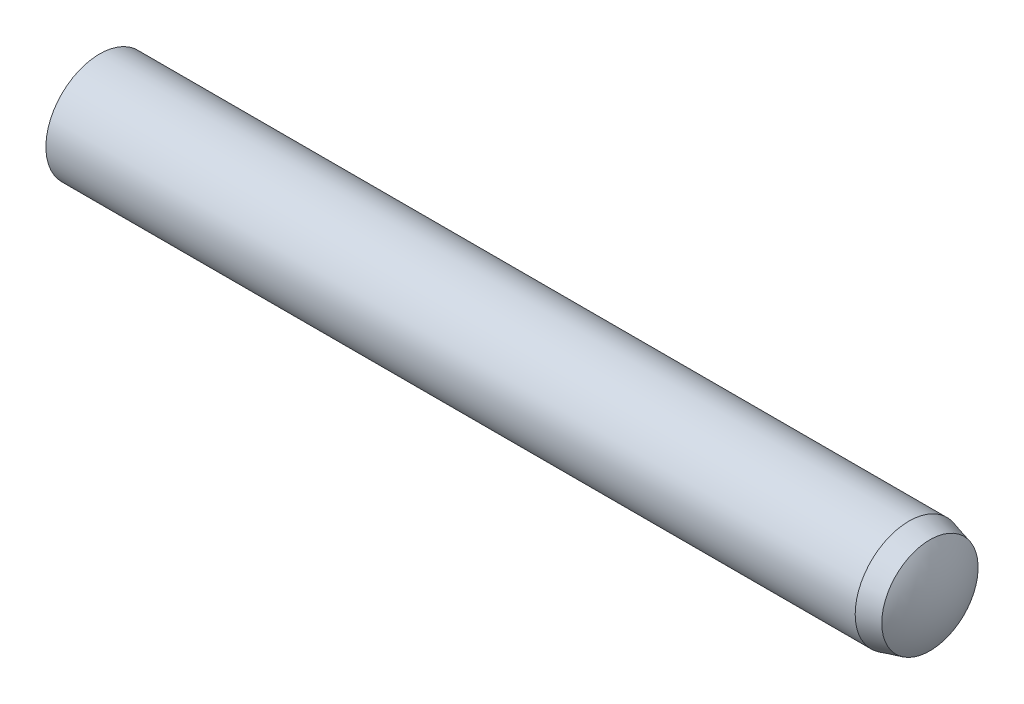
ISO-10303-21;
HEADER;
FILE_DESCRIPTION(('STEP AP214'),'2;1');
FILE_NAME('part.step','',(''),(''),'','','');
FILE_SCHEMA(('AUTOMOTIVE_DESIGN { 1 0 10303 214 1 1 1 1 }'));
ENDSEC;
DATA;
#1=APPLICATION_CONTEXT('core data for automotive mechanical design processes');
#2=APPLICATION_PROTOCOL_DEFINITION('international standard','automotive_design',2000,#1);
#3=PRODUCT_CONTEXT('',#1,'mechanical');
#4=PRODUCT('Part','Part','',(#3));
#5=PRODUCT_RELATED_PRODUCT_CATEGORY('part','',(#4));
#6=PRODUCT_DEFINITION_FORMATION('','',#4);
#7=PRODUCT_DEFINITION_CONTEXT('part definition',#1,'design');
#8=PRODUCT_DEFINITION('design','',#6,#7);
#9=PRODUCT_DEFINITION_SHAPE('','',#8);
#10=(LENGTH_UNIT() NAMED_UNIT(*) SI_UNIT(.MILLI.,.METRE.));
#11=(NAMED_UNIT(*) PLANE_ANGLE_UNIT() SI_UNIT($,.RADIAN.));
#12=(NAMED_UNIT(*) SI_UNIT($,.STERADIAN.) SOLID_ANGLE_UNIT());
#13=UNCERTAINTY_MEASURE_WITH_UNIT(LENGTH_MEASURE(1.E-05),#10,'distance_accuracy_value','');
#14=(GEOMETRIC_REPRESENTATION_CONTEXT(3) GLOBAL_UNCERTAINTY_ASSIGNED_CONTEXT((#13)) GLOBAL_UNIT_ASSIGNED_CONTEXT((#10,
#11,#12)) REPRESENTATION_CONTEXT('',''));
#15=CARTESIAN_POINT('',(0.,0.,0.));
#16=DIRECTION('',(0.,0.,1.));
#17=DIRECTION('',(1.,0.,0.));
#18=AXIS2_PLACEMENT_3D('',#15,#16,#17);
#19=CARTESIAN_POINT('',(7.9098078880317,0.,0.));
#20=DIRECTION('',(0.,1.,0.));
#21=DIRECTION('',(1.,0.,0.));
#22=AXIS2_PLACEMENT_3D('',#19,#20,#21);
#23=SPHERICAL_SURFACE('',#22,2.0901921119683);
#24=CARTESIAN_POINT('',(9.6749999999588,0.,0.));
#25=DIRECTION('',(-1.,0.,0.));
#26=DIRECTION('',(0.,0.,1.));
#27=AXIS2_PLACEMENT_3D('',#24,#25,#26);
#28=CIRCLE('',#27,1.11937476870594);
#29=CARTESIAN_POINT('',(9.6749999999588,0.,1.11937476870594));
#30=VERTEX_POINT('',#29);
#31=EDGE_CURVE('E18',#30,#30,#28,.T.);
#32=ORIENTED_EDGE('',*,*,#31,.F.);
#33=EDGE_LOOP('',(#32));
#34=FACE_BOUND('',#33,.T.);
#35=ADVANCED_FACE('F14',(#34),#23,.T.);
#36=CARTESIAN_POINT('',(9.18750000005275,0.,0.));
#37=DIRECTION('',(-1.,0.,0.));
#38=DIRECTION('',(0.,0.,1.));
#39=AXIS2_PLACEMENT_3D('',#36,#37,#38);
#40=CONICAL_SURFACE('',#39,1.24999999999886,0.261799387814319);
#41=CARTESIAN_POINT('',(9.1875,0.,0.));
#42=DIRECTION('',(1.,0.,0.));
#43=DIRECTION('',(0.,0.,-1.));
#44=AXIS2_PLACEMENT_3D('',#41,#42,#43);
#45=CIRCLE('',#44,1.25);
#46=CARTESIAN_POINT('',(9.1875,0.,-1.25));
#47=VERTEX_POINT('',#46);
#48=EDGE_CURVE('E10',#47,#47,#45,.F.);
#49=ORIENTED_EDGE('',*,*,#48,.F.);
#50=EDGE_LOOP('',(#49));
#51=FACE_BOUND('',#50,.T.);
#52=ORIENTED_EDGE('',*,*,#31,.T.);
#53=EDGE_LOOP('',(#52));
#54=FACE_BOUND('',#53,.T.);
#55=ADVANCED_FACE('F35',(#51,#54),#40,.T.);
#56=CARTESIAN_POINT('',(-7.72916666666667,0.,0.));
#57=DIRECTION('',(0.,1.,0.));
#58=DIRECTION('',(1.,0.,0.));
#59=AXIS2_PLACEMENT_3D('',#56,#57,#58);
#60=SPHERICAL_SURFACE('',#59,2.27083333333333);
#61=CARTESIAN_POINT('',(-9.625,0.,0.));
#62=DIRECTION('',(1.,0.,0.));
#63=DIRECTION('',(0.,0.,-1.));
#64=AXIS2_PLACEMENT_3D('',#61,#62,#63);
#65=CIRCLE('',#64,1.25);
#66=CARTESIAN_POINT('',(-9.625,0.,-1.25));
#67=VERTEX_POINT('',#66);
#68=EDGE_CURVE('E22',#67,#67,#65,.T.);
#69=ORIENTED_EDGE('',*,*,#68,.F.);
#70=EDGE_LOOP('',(#69));
#71=FACE_BOUND('',#70,.T.);
#72=ADVANCED_FACE('F31',(#71),#60,.T.);
#73=CARTESIAN_POINT('',(-10.,0.,0.));
#74=DIRECTION('',(1.,0.,0.));
#75=DIRECTION('',(0.,0.,-1.));
#76=AXIS2_PLACEMENT_3D('',#73,#74,#75);
#77=CYLINDRICAL_SURFACE('',#76,1.25);
#78=ORIENTED_EDGE('',*,*,#48,.T.);
#79=EDGE_LOOP('',(#78));
#80=FACE_BOUND('',#79,.T.);
#81=ORIENTED_EDGE('',*,*,#68,.T.);
#82=EDGE_LOOP('',(#81));
#83=FACE_BOUND('',#82,.T.);
#84=ADVANCED_FACE('F34',(#80,#83),#77,.T.);
#85=CLOSED_SHELL('',(#35,#55,#72,#84));
#86=MANIFOLD_SOLID_BREP('B1',#85);
#87=ADVANCED_BREP_SHAPE_REPRESENTATION('',(#18,#86),#14);
#88=SHAPE_DEFINITION_REPRESENTATION(#9,#87);
ENDSEC;
END-ISO-10303-21;
